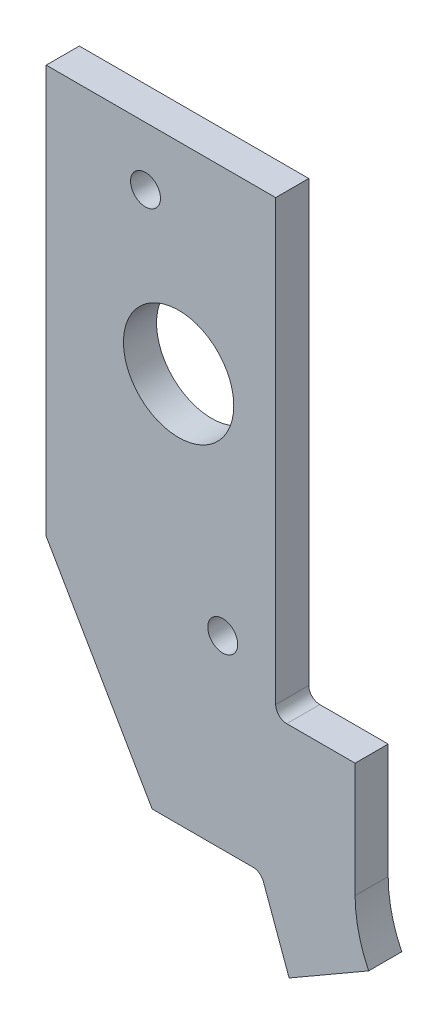
ISO-10303-21;
HEADER;
FILE_DESCRIPTION(('STEP AP214'),'2;1');
FILE_NAME('part.step','',(''),(''),'','','');
FILE_SCHEMA(('AUTOMOTIVE_DESIGN { 1 0 10303 214 1 1 1 1 }'));
ENDSEC;
DATA;
#1=APPLICATION_CONTEXT('core data for automotive mechanical design processes');
#2=APPLICATION_PROTOCOL_DEFINITION('international standard','automotive_design',2000,#1);
#3=PRODUCT_CONTEXT('',#1,'mechanical');
#4=PRODUCT('Part','Part','',(#3));
#5=PRODUCT_RELATED_PRODUCT_CATEGORY('part','',(#4));
#6=PRODUCT_DEFINITION_FORMATION('','',#4);
#7=PRODUCT_DEFINITION_CONTEXT('part definition',#1,'design');
#8=PRODUCT_DEFINITION('design','',#6,#7);
#9=PRODUCT_DEFINITION_SHAPE('','',#8);
#10=(LENGTH_UNIT() NAMED_UNIT(*) SI_UNIT(.MILLI.,.METRE.));
#11=(NAMED_UNIT(*) PLANE_ANGLE_UNIT() SI_UNIT($,.RADIAN.));
#12=(NAMED_UNIT(*) SI_UNIT($,.STERADIAN.) SOLID_ANGLE_UNIT());
#13=UNCERTAINTY_MEASURE_WITH_UNIT(LENGTH_MEASURE(1.E-05),#10,'distance_accuracy_value','');
#14=(GEOMETRIC_REPRESENTATION_CONTEXT(3) GLOBAL_UNCERTAINTY_ASSIGNED_CONTEXT((#13)) GLOBAL_UNIT_ASSIGNED_CONTEXT((#10,
#11,#12)) REPRESENTATION_CONTEXT('',''));
#15=CARTESIAN_POINT('',(0.,0.,0.));
#16=DIRECTION('',(0.,0.,1.));
#17=DIRECTION('',(1.,0.,0.));
#18=AXIS2_PLACEMENT_3D('',#15,#16,#17);
#19=CARTESIAN_POINT('',(-3165.37811817516,1098.54819471236,4.7625));
#20=DIRECTION('',(0.,0.,-1.));
#21=DIRECTION('',(-1.,0.,0.));
#22=AXIS2_PLACEMENT_3D('',#19,#20,#21);
#23=CYLINDRICAL_SURFACE('',#22,1.58749999999986);
#24=CARTESIAN_POINT('',(-3165.37811817516,1098.54819471236,0.));
#25=DIRECTION('',(0.,0.,-1.));
#26=DIRECTION('',(1.,0.,0.));
#27=AXIS2_PLACEMENT_3D('',#24,#25,#26);
#28=CIRCLE('',#27,1.58749999999986);
#29=CARTESIAN_POINT('',(-3165.37811817516,1100.13569471236,0.));
#30=VERTEX_POINT('',#29);
#31=CARTESIAN_POINT('',(-3163.88635613966,1099.09115168989,0.));
#32=VERTEX_POINT('',#31);
#33=EDGE_CURVE('E152',#30,#32,#28,.T.);
#34=ORIENTED_EDGE('',*,*,#33,.T.);
#35=DIRECTION('',(0.,0.,-1.));
#36=VECTOR('',#35,1.);
#37=CARTESIAN_POINT('',(-3163.88635613966,1099.09115168989,4.7625));
#38=LINE('',#37,#36);
#39=CARTESIAN_POINT('',(-3163.88635613966,1099.09115168989,4.7625));
#40=VERTEX_POINT('',#39);
#41=EDGE_CURVE('E11',#40,#32,#38,.T.);
#42=ORIENTED_EDGE('',*,*,#41,.F.);
#43=CARTESIAN_POINT('',(-3165.37811817516,1098.54819471236,4.7625));
#44=DIRECTION('',(0.,0.,-1.));
#45=DIRECTION('',(1.,0.,0.));
#46=AXIS2_PLACEMENT_3D('',#43,#44,#45);
#47=CIRCLE('',#46,1.58749999999986);
#48=CARTESIAN_POINT('',(-3165.37811817516,1100.13569471236,4.7625));
#49=VERTEX_POINT('',#48);
#50=EDGE_CURVE('E175',#49,#40,#47,.T.);
#51=ORIENTED_EDGE('',*,*,#50,.F.);
#52=DIRECTION('',(0.,0.,-1.));
#53=VECTOR('',#52,1.);
#54=CARTESIAN_POINT('',(-3165.37811817516,1100.13569471236,4.7625));
#55=LINE('',#54,#53);
#56=EDGE_CURVE('E148',#49,#30,#55,.T.);
#57=ORIENTED_EDGE('',*,*,#56,.T.);
#58=EDGE_LOOP('',(#34,#42,#51,#57));
#59=FACE_BOUND('',#58,.T.);
#60=ADVANCED_FACE('F32',(#59),#23,.F.);
#61=CARTESIAN_POINT('',(-3163.88635613966,1099.09115168989,4.7625));
#62=DIRECTION('',(0.939692620785908,0.342020143325669,0.));
#63=DIRECTION('',(-0.342020143325669,0.939692620785908,0.));
#64=AXIS2_PLACEMENT_3D('',#61,#62,#63);
#65=PLANE('',#64);
#66=DIRECTION('',(0.342020143325669,-0.939692620785908,0.));
#67=VECTOR('',#66,1.);
#68=CARTESIAN_POINT('',(-3163.88635613966,1099.09115168989,0.));
#69=LINE('',#68,#67);
#70=CARTESIAN_POINT('',(-3160.18777432227,1088.92938166261,0.));
#71=VERTEX_POINT('',#70);
#72=EDGE_CURVE('E155',#32,#71,#69,.T.);
#73=ORIENTED_EDGE('',*,*,#72,.T.);
#74=DIRECTION('',(0.,0.,-1.));
#75=VECTOR('',#74,1.);
#76=CARTESIAN_POINT('',(-3160.18777432227,1088.92938166261,4.7625));
#77=LINE('',#76,#75);
#78=CARTESIAN_POINT('',(-3160.18777432227,1088.92938166261,4.7625));
#79=VERTEX_POINT('',#78);
#80=EDGE_CURVE('E40',#79,#71,#77,.T.);
#81=ORIENTED_EDGE('',*,*,#80,.F.);
#82=DIRECTION('',(0.342020143325669,-0.939692620785908,0.));
#83=VECTOR('',#82,1.);
#84=CARTESIAN_POINT('',(-3163.88635613966,1099.09115168989,4.7625));
#85=LINE('',#84,#83);
#86=EDGE_CURVE('E103',#40,#79,#85,.T.);
#87=ORIENTED_EDGE('',*,*,#86,.F.);
#88=ORIENTED_EDGE('',*,*,#41,.T.);
#89=EDGE_LOOP('',(#73,#81,#87,#88));
#90=FACE_BOUND('',#89,.T.);
#91=ADVANCED_FACE('F254',(#90),#65,.F.);
#92=CARTESIAN_POINT('',(-3160.18777432227,1088.92938166261,4.7625));
#93=DIRECTION('',(-0.499999999999998,0.86602540378444,0.));
#94=DIRECTION('',(-0.86602540378444,-0.499999999999998,0.));
#95=AXIS2_PLACEMENT_3D('',#92,#93,#94);
#96=PLANE('',#95);
#97=DIRECTION('',(0.86602540378444,0.499999999999998,0.));
#98=VECTOR('',#97,1.);
#99=CARTESIAN_POINT('',(-3160.18777432227,1088.92938166261,0.));
#100=LINE('',#99,#98);
#101=CARTESIAN_POINT('',(-3148.7348385517,1095.54173721276,0.));
#102=VERTEX_POINT('',#101);
#103=EDGE_CURVE('E158',#71,#102,#100,.T.);
#104=ORIENTED_EDGE('',*,*,#103,.T.);
#105=DIRECTION('',(0.,0.,-1.));
#106=VECTOR('',#105,1.);
#107=CARTESIAN_POINT('',(-3148.7348385517,1095.54173721276,4.7625));
#108=LINE('',#107,#106);
#109=CARTESIAN_POINT('',(-3148.7348385517,1095.54173721276,4.7625));
#110=VERTEX_POINT('',#109);
#111=EDGE_CURVE('E194',#110,#102,#108,.T.);
#112=ORIENTED_EDGE('',*,*,#111,.F.);
#113=DIRECTION('',(0.86602540378444,0.499999999999998,0.));
#114=VECTOR('',#113,1.);
#115=CARTESIAN_POINT('',(-3160.18777432227,1088.92938166261,4.7625));
#116=LINE('',#115,#114);
#117=EDGE_CURVE('E202',#79,#110,#116,.T.);
#118=ORIENTED_EDGE('',*,*,#117,.F.);
#119=ORIENTED_EDGE('',*,*,#80,.T.);
#120=EDGE_LOOP('',(#104,#112,#118,#119));
#121=FACE_BOUND('',#120,.T.);
#122=ADVANCED_FACE('F200',(#121),#96,.F.);
#123=CARTESIAN_POINT('',(-3131.63875717774,1103.94569471236,4.7625));
#124=DIRECTION('',(0.,0.,-1.));
#125=DIRECTION('',(-1.,0.,0.));
#126=AXIS2_PLACEMENT_3D('',#123,#124,#125);
#127=CYLINDRICAL_SURFACE('',#126,19.05);
#128=CARTESIAN_POINT('',(-3131.63875717774,1103.94569471236,0.));
#129=DIRECTION('',(0.,0.,-1.));
#130=DIRECTION('',(1.,0.,0.));
#131=AXIS2_PLACEMENT_3D('',#128,#129,#130);
#132=CIRCLE('',#131,19.05);
#133=CARTESIAN_POINT('',(-3150.68875717774,1103.94569471236,0.));
#134=VERTEX_POINT('',#133);
#135=EDGE_CURVE('E160',#102,#134,#132,.T.);
#136=ORIENTED_EDGE('',*,*,#135,.T.);
#137=DIRECTION('',(0.,0.,-1.));
#138=VECTOR('',#137,1.);
#139=CARTESIAN_POINT('',(-3150.68875717774,1103.94569471236,4.7625));
#140=LINE('',#139,#138);
#141=CARTESIAN_POINT('',(-3150.68875717774,1103.94569471236,4.7625));
#142=VERTEX_POINT('',#141);
#143=EDGE_CURVE('E191',#142,#134,#140,.T.);
#144=ORIENTED_EDGE('',*,*,#143,.F.);
#145=CARTESIAN_POINT('',(-3131.63875717774,1103.94569471236,4.7625));
#146=DIRECTION('',(0.,0.,-1.));
#147=DIRECTION('',(1.,0.,0.));
#148=AXIS2_PLACEMENT_3D('',#145,#146,#147);
#149=CIRCLE('',#148,19.05);
#150=EDGE_CURVE('E220',#110,#142,#149,.T.);
#151=ORIENTED_EDGE('',*,*,#150,.F.);
#152=ORIENTED_EDGE('',*,*,#111,.T.);
#153=EDGE_LOOP('',(#136,#144,#151,#152));
#154=FACE_BOUND('',#153,.T.);
#155=ADVANCED_FACE('F211',(#154),#127,.F.);
#156=CARTESIAN_POINT('',(-3150.68875717774,1103.94569471236,4.7625));
#157=DIRECTION('',(-1.,0.,0.));
#158=DIRECTION('',(0.,0.,1.));
#159=AXIS2_PLACEMENT_3D('',#156,#157,#158);
#160=PLANE('',#159);
#161=DIRECTION('',(0.,1.,0.));
#162=VECTOR('',#161,1.);
#163=CARTESIAN_POINT('',(-3150.68875717774,1103.94569471236,0.));
#164=LINE('',#163,#162);
#165=CARTESIAN_POINT('',(-3150.68875717774,1120.45569471236,0.));
#166=VERTEX_POINT('',#165);
#167=EDGE_CURVE('E162',#134,#166,#164,.T.);
#168=ORIENTED_EDGE('',*,*,#167,.T.);
#169=DIRECTION('',(0.,0.,-1.));
#170=VECTOR('',#169,1.);
#171=CARTESIAN_POINT('',(-3150.68875717774,1120.45569471236,4.7625));
#172=LINE('',#171,#170);
#173=CARTESIAN_POINT('',(-3150.68875717774,1120.45569471236,4.7625));
#174=VERTEX_POINT('',#173);
#175=EDGE_CURVE('E188',#174,#166,#172,.T.);
#176=ORIENTED_EDGE('',*,*,#175,.F.);
#177=DIRECTION('',(0.,1.,0.));
#178=VECTOR('',#177,1.);
#179=CARTESIAN_POINT('',(-3150.68875717774,1103.94569471236,4.7625));
#180=LINE('',#179,#178);
#181=EDGE_CURVE('E217',#142,#174,#180,.T.);
#182=ORIENTED_EDGE('',*,*,#181,.F.);
#183=ORIENTED_EDGE('',*,*,#143,.T.);
#184=EDGE_LOOP('',(#168,#176,#182,#183));
#185=FACE_BOUND('',#184,.T.);
#186=ADVANCED_FACE('F215',(#185),#160,.F.);
#187=CARTESIAN_POINT('',(-3150.68875717774,1120.45569471236,4.7625));
#188=DIRECTION('',(0.,-1.,0.));
#189=DIRECTION('',(0.,0.,-1.));
#190=AXIS2_PLACEMENT_3D('',#187,#188,#189);
#191=PLANE('',#190);
#192=DIRECTION('',(-1.,0.,0.));
#193=VECTOR('',#192,1.);
#194=CARTESIAN_POINT('',(-3150.68875717774,1120.45569471236,0.));
#195=LINE('',#194,#193);
#196=CARTESIAN_POINT('',(-3160.53125717774,1120.45569471236,0.));
#197=VERTEX_POINT('',#196);
#198=EDGE_CURVE('E164',#166,#197,#195,.T.);
#199=ORIENTED_EDGE('',*,*,#198,.T.);
#200=DIRECTION('',(0.,0.,-1.));
#201=VECTOR('',#200,1.);
#202=CARTESIAN_POINT('',(-3160.53125717774,1120.45569471236,4.7625));
#203=LINE('',#202,#201);
#204=CARTESIAN_POINT('',(-3160.53125717774,1120.45569471236,4.7625));
#205=VERTEX_POINT('',#204);
#206=EDGE_CURVE('E185',#205,#197,#203,.T.);
#207=ORIENTED_EDGE('',*,*,#206,.F.);
#208=DIRECTION('',(-1.,0.,0.));
#209=VECTOR('',#208,1.);
#210=CARTESIAN_POINT('',(-3150.68875717774,1120.45569471236,4.7625));
#211=LINE('',#210,#209);
#212=EDGE_CURVE('E219',#174,#205,#211,.T.);
#213=ORIENTED_EDGE('',*,*,#212,.F.);
#214=ORIENTED_EDGE('',*,*,#175,.T.);
#215=EDGE_LOOP('',(#199,#207,#213,#214));
#216=FACE_BOUND('',#215,.T.);
#217=ADVANCED_FACE('F267',(#216),#191,.F.);
#218=CARTESIAN_POINT('',(-3160.53125717774,1122.04319471236,4.7625));
#219=DIRECTION('',(0.,0.,-1.));
#220=DIRECTION('',(-1.,0.,0.));
#221=AXIS2_PLACEMENT_3D('',#218,#219,#220);
#222=CYLINDRICAL_SURFACE('',#221,1.58749999999996);
#223=CARTESIAN_POINT('',(-3160.53125717774,1122.04319471236,0.));
#224=DIRECTION('',(0.,0.,-1.));
#225=DIRECTION('',(1.,0.,0.));
#226=AXIS2_PLACEMENT_3D('',#223,#224,#225);
#227=CIRCLE('',#226,1.58749999999996);
#228=CARTESIAN_POINT('',(-3162.11875717774,1122.04319471236,0.));
#229=VERTEX_POINT('',#228);
#230=EDGE_CURVE('E166',#197,#229,#227,.T.);
#231=ORIENTED_EDGE('',*,*,#230,.T.);
#232=DIRECTION('',(0.,0.,-1.));
#233=VECTOR('',#232,1.);
#234=CARTESIAN_POINT('',(-3162.11875717774,1122.04319471236,4.7625));
#235=LINE('',#234,#233);
#236=CARTESIAN_POINT('',(-3162.11875717774,1122.04319471236,4.7625));
#237=VERTEX_POINT('',#236);
#238=EDGE_CURVE('E182',#237,#229,#235,.T.);
#239=ORIENTED_EDGE('',*,*,#238,.F.);
#240=CARTESIAN_POINT('',(-3160.53125717774,1122.04319471236,4.7625));
#241=DIRECTION('',(0.,0.,-1.));
#242=DIRECTION('',(1.,0.,0.));
#243=AXIS2_PLACEMENT_3D('',#240,#241,#242);
#244=CIRCLE('',#243,1.58749999999996);
#245=EDGE_CURVE('E222',#205,#237,#244,.T.);
#246=ORIENTED_EDGE('',*,*,#245,.F.);
#247=ORIENTED_EDGE('',*,*,#206,.T.);
#248=EDGE_LOOP('',(#231,#239,#246,#247));
#249=FACE_BOUND('',#248,.T.);
#250=ADVANCED_FACE('F270',(#249),#222,.F.);
#251=CARTESIAN_POINT('',(-3162.11875717774,1122.04319471236,4.7625));
#252=DIRECTION('',(-1.,0.,0.));
#253=DIRECTION('',(0.,0.,1.));
#254=AXIS2_PLACEMENT_3D('',#251,#252,#253);
#255=PLANE('',#254);
#256=DIRECTION('',(0.,1.,0.));
#257=VECTOR('',#256,1.);
#258=CARTESIAN_POINT('',(-3162.11875717774,1122.04319471236,0.));
#259=LINE('',#258,#257);
#260=CARTESIAN_POINT('',(-3162.11875717774,1185.22569471236,0.));
#261=VERTEX_POINT('',#260);
#262=EDGE_CURVE('E168',#229,#261,#259,.T.);
#263=ORIENTED_EDGE('',*,*,#262,.T.);
#264=DIRECTION('',(0.,0.,-1.));
#265=VECTOR('',#264,1.);
#266=CARTESIAN_POINT('',(-3162.11875717774,1185.22569471236,4.7625));
#267=LINE('',#266,#265);
#268=CARTESIAN_POINT('',(-3162.11875717774,1185.22569471236,4.7625));
#269=VERTEX_POINT('',#268);
#270=EDGE_CURVE('E179',#269,#261,#267,.T.);
#271=ORIENTED_EDGE('',*,*,#270,.F.);
#272=DIRECTION('',(0.,1.,0.));
#273=VECTOR('',#272,1.);
#274=CARTESIAN_POINT('',(-3162.11875717774,1122.04319471236,4.7625));
#275=LINE('',#274,#273);
#276=EDGE_CURVE('E228',#237,#269,#275,.T.);
#277=ORIENTED_EDGE('',*,*,#276,.F.);
#278=ORIENTED_EDGE('',*,*,#238,.T.);
#279=EDGE_LOOP('',(#263,#271,#277,#278));
#280=FACE_BOUND('',#279,.T.);
#281=ADVANCED_FACE('F234',(#280),#255,.F.);
#282=CARTESIAN_POINT('',(-3162.11875717774,1185.22569471236,4.7625));
#283=DIRECTION('',(0.,-1.,0.));
#284=DIRECTION('',(0.,0.,-1.));
#285=AXIS2_PLACEMENT_3D('',#282,#283,#284);
#286=PLANE('',#285);
#287=DIRECTION('',(-1.,0.,0.));
#288=VECTOR('',#287,1.);
#289=CARTESIAN_POINT('',(-3162.11875717774,1185.22569471236,0.));
#290=LINE('',#289,#288);
#291=CARTESIAN_POINT('',(-3195.13875717774,1185.22569471236,0.));
#292=VERTEX_POINT('',#291);
#293=EDGE_CURVE('E170',#261,#292,#290,.T.);
#294=ORIENTED_EDGE('',*,*,#293,.T.);
#295=DIRECTION('',(0.,0.,-1.));
#296=VECTOR('',#295,1.);
#297=CARTESIAN_POINT('',(-3195.13875717774,1185.22569471236,4.7625));
#298=LINE('',#297,#296);
#299=CARTESIAN_POINT('',(-3195.13875717774,1185.22569471236,4.7625));
#300=VERTEX_POINT('',#299);
#301=EDGE_CURVE('E143',#300,#292,#298,.T.);
#302=ORIENTED_EDGE('',*,*,#301,.F.);
#303=DIRECTION('',(-1.,0.,0.));
#304=VECTOR('',#303,1.);
#305=CARTESIAN_POINT('',(-3162.11875717774,1185.22569471236,4.7625));
#306=LINE('',#305,#304);
#307=EDGE_CURVE('E134',#269,#300,#306,.T.);
#308=ORIENTED_EDGE('',*,*,#307,.F.);
#309=ORIENTED_EDGE('',*,*,#270,.T.);
#310=EDGE_LOOP('',(#294,#302,#308,#309));
#311=FACE_BOUND('',#310,.T.);
#312=ADVANCED_FACE('F238',(#311),#286,.F.);
#313=CARTESIAN_POINT('',(-3195.13875717774,1185.22569471236,4.7625));
#314=DIRECTION('',(1.,0.,0.));
#315=DIRECTION('',(0.,0.,-1.));
#316=AXIS2_PLACEMENT_3D('',#313,#314,#315);
#317=PLANE('',#316);
#318=DIRECTION('',(0.,-1.,0.));
#319=VECTOR('',#318,1.);
#320=CARTESIAN_POINT('',(-3195.13875717774,1185.22569471236,0.));
#321=LINE('',#320,#319);
#322=CARTESIAN_POINT('',(-3195.13875717774,1126.48819471236,0.));
#323=VERTEX_POINT('',#322);
#324=EDGE_CURVE('E142',#292,#323,#321,.T.);
#325=ORIENTED_EDGE('',*,*,#324,.T.);
#326=DIRECTION('',(0.,0.,-1.));
#327=VECTOR('',#326,1.);
#328=CARTESIAN_POINT('',(-3195.13875717774,1126.48819471236,4.7625));
#329=LINE('',#328,#327);
#330=CARTESIAN_POINT('',(-3195.13875717774,1126.48819471236,4.7625));
#331=VERTEX_POINT('',#330);
#332=EDGE_CURVE('E139',#331,#323,#329,.T.);
#333=ORIENTED_EDGE('',*,*,#332,.F.);
#334=DIRECTION('',(0.,-1.,0.));
#335=VECTOR('',#334,1.);
#336=CARTESIAN_POINT('',(-3195.13875717774,1185.22569471236,4.7625));
#337=LINE('',#336,#335);
#338=EDGE_CURVE('E128',#300,#331,#337,.T.);
#339=ORIENTED_EDGE('',*,*,#338,.F.);
#340=ORIENTED_EDGE('',*,*,#301,.T.);
#341=EDGE_LOOP('',(#325,#333,#339,#340));
#342=FACE_BOUND('',#341,.T.);
#343=ADVANCED_FACE('F140',(#342),#317,.F.);
#344=CARTESIAN_POINT('',(-3195.13875717774,1126.48819471236,4.7625));
#345=DIRECTION('',(0.865664209780223,0.500625085174107,0.));
#346=DIRECTION('',(-0.500625085174107,0.865664209780224,0.));
#347=AXIS2_PLACEMENT_3D('',#344,#345,#346);
#348=PLANE('',#347);
#349=DIRECTION('',(0.500625085174107,-0.865664209780223,0.));
#350=VECTOR('',#349,1.);
#351=CARTESIAN_POINT('',(-3195.13875717774,1126.48819471236,0.));
#352=LINE('',#351,#350);
#353=CARTESIAN_POINT('',(-3179.89875717774,1100.13569471236,0.));
#354=VERTEX_POINT('',#353);
#355=EDGE_CURVE('E89',#323,#354,#352,.T.);
#356=ORIENTED_EDGE('',*,*,#355,.T.);
#357=DIRECTION('',(0.,0.,-1.));
#358=VECTOR('',#357,1.);
#359=CARTESIAN_POINT('',(-3179.89875717774,1100.13569471236,4.7625));
#360=LINE('',#359,#358);
#361=CARTESIAN_POINT('',(-3179.89875717774,1100.13569471236,4.7625));
#362=VERTEX_POINT('',#361);
#363=EDGE_CURVE('E144',#362,#354,#360,.T.);
#364=ORIENTED_EDGE('',*,*,#363,.F.);
#365=DIRECTION('',(0.500625085174107,-0.865664209780223,0.));
#366=VECTOR('',#365,1.);
#367=CARTESIAN_POINT('',(-3195.13875717774,1126.48819471236,4.7625));
#368=LINE('',#367,#366);
#369=EDGE_CURVE('E132',#331,#362,#368,.T.);
#370=ORIENTED_EDGE('',*,*,#369,.F.);
#371=ORIENTED_EDGE('',*,*,#332,.T.);
#372=EDGE_LOOP('',(#356,#364,#370,#371));
#373=FACE_BOUND('',#372,.T.);
#374=ADVANCED_FACE('F146',(#373),#348,.F.);
#375=CARTESIAN_POINT('',(-3179.89875717774,1100.13569471236,4.7625));
#376=DIRECTION('',(0.,1.,0.));
#377=DIRECTION('',(-1.,0.,0.));
#378=AXIS2_PLACEMENT_3D('',#375,#376,#377);
#379=PLANE('',#378);
#380=DIRECTION('',(1.,0.,0.));
#381=VECTOR('',#380,1.);
#382=CARTESIAN_POINT('',(-3179.89875717774,1100.13569471236,0.));
#383=LINE('',#382,#381);
#384=EDGE_CURVE('E95',#354,#30,#383,.T.);
#385=ORIENTED_EDGE('',*,*,#384,.T.);
#386=ORIENTED_EDGE('',*,*,#56,.F.);
#387=DIRECTION('',(1.,0.,0.));
#388=VECTOR('',#387,1.);
#389=CARTESIAN_POINT('',(-3179.89875717774,1100.13569471236,4.7625));
#390=LINE('',#389,#388);
#391=EDGE_CURVE('E48',#362,#49,#390,.T.);
#392=ORIENTED_EDGE('',*,*,#391,.F.);
#393=ORIENTED_EDGE('',*,*,#363,.T.);
#394=EDGE_LOOP('',(#385,#386,#392,#393));
#395=FACE_BOUND('',#394,.T.);
#396=ADVANCED_FACE('F242',(#395),#379,.F.);
#397=CARTESIAN_POINT('',(-3165.37811817516,1098.54819471236,4.7625));
#398=DIRECTION('',(0.,0.,1.));
#399=DIRECTION('',(1.,0.,0.));
#400=AXIS2_PLACEMENT_3D('',#397,#398,#399);
#401=PLANE('',#400);
#402=CARTESIAN_POINT('',(-3176.08875717774,1156.26969471236,4.7625));
#403=DIRECTION('',(0.,0.,1.));
#404=DIRECTION('',(1.,0.,0.));
#405=AXIS2_PLACEMENT_3D('',#402,#403,#404);
#406=CIRCLE('',#405,7.93750000000015);
#407=CARTESIAN_POINT('',(-3168.15125717774,1156.26969471236,4.7625));
#408=VERTEX_POINT('',#407);
#409=EDGE_CURVE('E346',#408,#408,#406,.T.);
#410=ORIENTED_EDGE('',*,*,#409,.F.);
#411=EDGE_LOOP('',(#410));
#412=FACE_BOUND('',#411,.T.);
#413=CARTESIAN_POINT('',(-3169.73875717774,1126.80569471236,4.7625));
#414=DIRECTION('',(0.,0.,1.));
#415=DIRECTION('',(1.,0.,0.));
#416=AXIS2_PLACEMENT_3D('',#413,#414,#415);
#417=CIRCLE('',#416,2.1526500000002);
#418=CARTESIAN_POINT('',(-3167.58610717774,1126.80569471236,4.7625));
#419=VERTEX_POINT('',#418);
#420=EDGE_CURVE('E348',#419,#419,#417,.T.);
#421=ORIENTED_EDGE('',*,*,#420,.F.);
#422=EDGE_LOOP('',(#421));
#423=FACE_BOUND('',#422,.T.);
#424=CARTESIAN_POINT('',(-3180.85125717774,1176.84369471236,4.7625));
#425=DIRECTION('',(0.,0.,1.));
#426=DIRECTION('',(1.,0.,0.));
#427=AXIS2_PLACEMENT_3D('',#424,#425,#426);
#428=CIRCLE('',#427,2.1526500000002);
#429=CARTESIAN_POINT('',(-3178.69860717774,1176.84369471236,4.7625));
#430=VERTEX_POINT('',#429);
#431=EDGE_CURVE('E356',#430,#430,#428,.T.);
#432=ORIENTED_EDGE('',*,*,#431,.F.);
#433=EDGE_LOOP('',(#432));
#434=FACE_BOUND('',#433,.T.);
#435=ORIENTED_EDGE('',*,*,#50,.T.);
#436=ORIENTED_EDGE('',*,*,#86,.T.);
#437=ORIENTED_EDGE('',*,*,#117,.T.);
#438=ORIENTED_EDGE('',*,*,#150,.T.);
#439=ORIENTED_EDGE('',*,*,#181,.T.);
#440=ORIENTED_EDGE('',*,*,#212,.T.);
#441=ORIENTED_EDGE('',*,*,#245,.T.);
#442=ORIENTED_EDGE('',*,*,#276,.T.);
#443=ORIENTED_EDGE('',*,*,#307,.T.);
#444=ORIENTED_EDGE('',*,*,#338,.T.);
#445=ORIENTED_EDGE('',*,*,#369,.T.);
#446=ORIENTED_EDGE('',*,*,#391,.T.);
#447=EDGE_LOOP('',(#435,#436,#437,#438,#439,#440,#441,#442,#443,#444,#445,#446));
#448=FACE_BOUND('',#447,.T.);
#449=ADVANCED_FACE('F130',(#412,#423,#434,#448),#401,.T.);
#450=CARTESIAN_POINT('',(-3165.37811817516,1098.54819471236,0.));
#451=DIRECTION('',(0.,0.,1.));
#452=DIRECTION('',(1.,0.,0.));
#453=AXIS2_PLACEMENT_3D('',#450,#451,#452);
#454=PLANE('',#453);
#455=CARTESIAN_POINT('',(-3176.08875717774,1156.26969471236,0.));
#456=DIRECTION('',(0.,0.,1.));
#457=DIRECTION('',(1.,0.,0.));
#458=AXIS2_PLACEMENT_3D('',#455,#456,#457);
#459=CIRCLE('',#458,7.93750000000015);
#460=CARTESIAN_POINT('',(-3168.15125717774,1156.26969471236,0.));
#461=VERTEX_POINT('',#460);
#462=EDGE_CURVE('E343',#461,#461,#459,.T.);
#463=ORIENTED_EDGE('',*,*,#462,.T.);
#464=EDGE_LOOP('',(#463));
#465=FACE_BOUND('',#464,.T.);
#466=CARTESIAN_POINT('',(-3169.73875717774,1126.80569471236,0.));
#467=DIRECTION('',(0.,0.,1.));
#468=DIRECTION('',(1.,0.,0.));
#469=AXIS2_PLACEMENT_3D('',#466,#467,#468);
#470=CIRCLE('',#469,2.1526500000002);
#471=CARTESIAN_POINT('',(-3167.58610717774,1126.80569471236,0.));
#472=VERTEX_POINT('',#471);
#473=EDGE_CURVE('E353',#472,#472,#470,.T.);
#474=ORIENTED_EDGE('',*,*,#473,.T.);
#475=EDGE_LOOP('',(#474));
#476=FACE_BOUND('',#475,.T.);
#477=CARTESIAN_POINT('',(-3180.85125717774,1176.84369471236,0.));
#478=DIRECTION('',(0.,0.,1.));
#479=DIRECTION('',(1.,0.,0.));
#480=AXIS2_PLACEMENT_3D('',#477,#478,#479);
#481=CIRCLE('',#480,2.1526500000002);
#482=CARTESIAN_POINT('',(-3178.69860717774,1176.84369471236,0.));
#483=VERTEX_POINT('',#482);
#484=EDGE_CURVE('E156',#483,#483,#481,.T.);
#485=ORIENTED_EDGE('',*,*,#484,.T.);
#486=EDGE_LOOP('',(#485));
#487=FACE_BOUND('',#486,.T.);
#488=ORIENTED_EDGE('',*,*,#33,.F.);
#489=ORIENTED_EDGE('',*,*,#384,.F.);
#490=ORIENTED_EDGE('',*,*,#355,.F.);
#491=ORIENTED_EDGE('',*,*,#324,.F.);
#492=ORIENTED_EDGE('',*,*,#293,.F.);
#493=ORIENTED_EDGE('',*,*,#262,.F.);
#494=ORIENTED_EDGE('',*,*,#230,.F.);
#495=ORIENTED_EDGE('',*,*,#198,.F.);
#496=ORIENTED_EDGE('',*,*,#167,.F.);
#497=ORIENTED_EDGE('',*,*,#135,.F.);
#498=ORIENTED_EDGE('',*,*,#103,.F.);
#499=ORIENTED_EDGE('',*,*,#72,.F.);
#500=EDGE_LOOP('',(#488,#489,#490,#491,#492,#493,#494,#495,#496,#497,#498,#499));
#501=FACE_BOUND('',#500,.T.);
#502=ADVANCED_FACE('F206',(#465,#476,#487,#501),#454,.F.);
#503=CARTESIAN_POINT('',(-3180.85125717774,1176.84369471236,4.7625));
#504=DIRECTION('',(0.,0.,1.));
#505=DIRECTION('',(1.,0.,0.));
#506=AXIS2_PLACEMENT_3D('',#503,#504,#505);
#507=CYLINDRICAL_SURFACE('',#506,2.1526500000002);
#508=ORIENTED_EDGE('',*,*,#484,.F.);
#509=EDGE_LOOP('',(#508));
#510=FACE_BOUND('',#509,.T.);
#511=ORIENTED_EDGE('',*,*,#431,.T.);
#512=EDGE_LOOP('',(#511));
#513=FACE_BOUND('',#512,.T.);
#514=ADVANCED_FACE('F298',(#510,#513),#507,.F.);
#515=CARTESIAN_POINT('',(-3169.73875717774,1126.80569471236,4.7625));
#516=DIRECTION('',(0.,0.,1.));
#517=DIRECTION('',(1.,0.,0.));
#518=AXIS2_PLACEMENT_3D('',#515,#516,#517);
#519=CYLINDRICAL_SURFACE('',#518,2.1526500000002);
#520=ORIENTED_EDGE('',*,*,#473,.F.);
#521=EDGE_LOOP('',(#520));
#522=FACE_BOUND('',#521,.T.);
#523=ORIENTED_EDGE('',*,*,#420,.T.);
#524=EDGE_LOOP('',(#523));
#525=FACE_BOUND('',#524,.T.);
#526=ADVANCED_FACE('F303',(#522,#525),#519,.F.);
#527=CARTESIAN_POINT('',(-3176.08875717774,1156.26969471236,4.7625));
#528=DIRECTION('',(0.,0.,1.));
#529=DIRECTION('',(1.,0.,0.));
#530=AXIS2_PLACEMENT_3D('',#527,#528,#529);
#531=CYLINDRICAL_SURFACE('',#530,7.93750000000015);
#532=ORIENTED_EDGE('',*,*,#462,.F.);
#533=EDGE_LOOP('',(#532));
#534=FACE_BOUND('',#533,.T.);
#535=ORIENTED_EDGE('',*,*,#409,.T.);
#536=EDGE_LOOP('',(#535));
#537=FACE_BOUND('',#536,.T.);
#538=ADVANCED_FACE('F315',(#534,#537),#531,.F.);
#539=CLOSED_SHELL('',(#60,#91,#122,#155,#186,#217,#250,#281,#312,#343,#374,#396,#449,#502,#514,
#526,#538));
#540=MANIFOLD_SOLID_BREP('B2',#539);
#541=ADVANCED_BREP_SHAPE_REPRESENTATION('',(#18,#540),#14);
#542=SHAPE_DEFINITION_REPRESENTATION(#9,#541);
ENDSEC;
END-ISO-10303-21;
